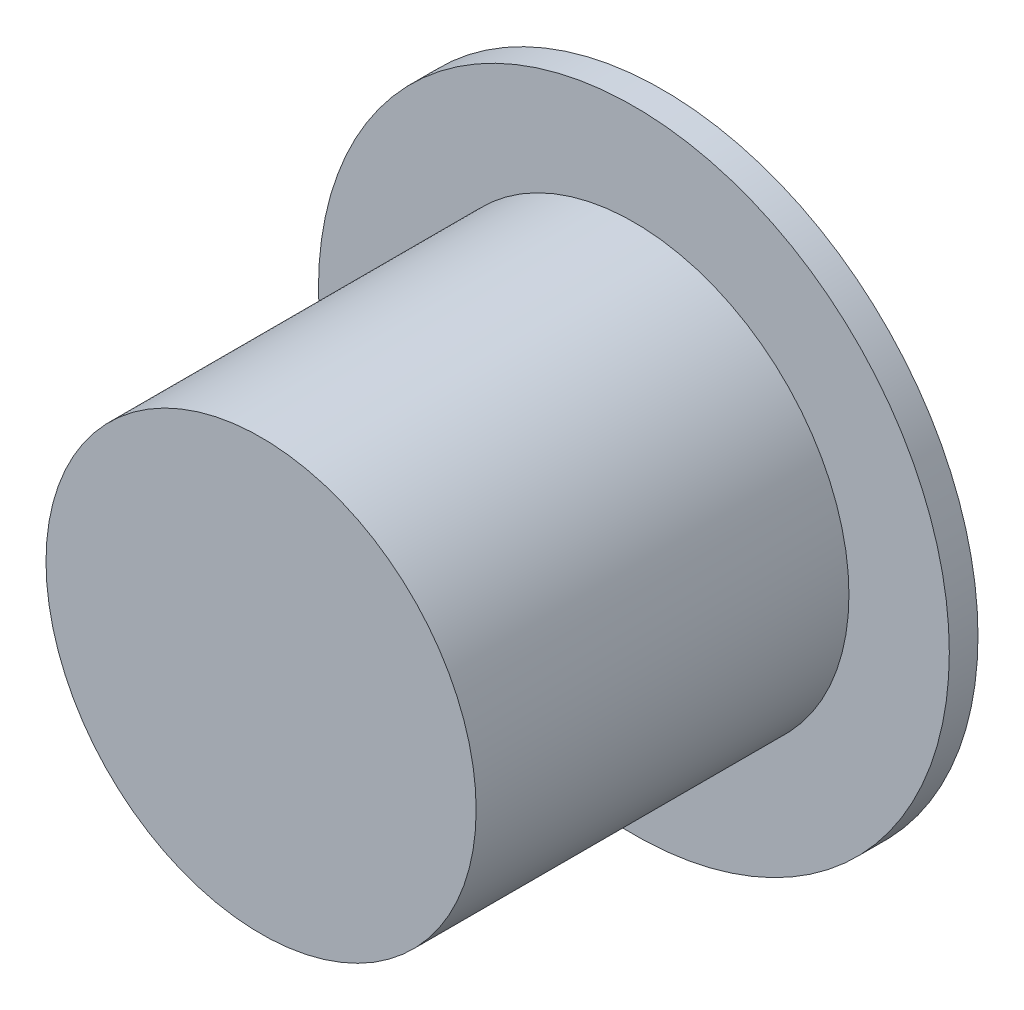
ISO-10303-21;
HEADER;
FILE_DESCRIPTION(('STEP AP214'),'2;1');
FILE_NAME('part.step','',(''),(''),'','','');
FILE_SCHEMA(('AUTOMOTIVE_DESIGN { 1 0 10303 214 1 1 1 1 }'));
ENDSEC;
DATA;
#1=APPLICATION_CONTEXT('core data for automotive mechanical design processes');
#2=APPLICATION_PROTOCOL_DEFINITION('international standard','automotive_design',2000,#1);
#3=PRODUCT_CONTEXT('',#1,'mechanical');
#4=PRODUCT('Part','Part','',(#3));
#5=PRODUCT_RELATED_PRODUCT_CATEGORY('part','',(#4));
#6=PRODUCT_DEFINITION_FORMATION('','',#4);
#7=PRODUCT_DEFINITION_CONTEXT('part definition',#1,'design');
#8=PRODUCT_DEFINITION('design','',#6,#7);
#9=PRODUCT_DEFINITION_SHAPE('','',#8);
#10=(LENGTH_UNIT() NAMED_UNIT(*) SI_UNIT(.MILLI.,.METRE.));
#11=(NAMED_UNIT(*) PLANE_ANGLE_UNIT() SI_UNIT($,.RADIAN.));
#12=(NAMED_UNIT(*) SI_UNIT($,.STERADIAN.) SOLID_ANGLE_UNIT());
#13=UNCERTAINTY_MEASURE_WITH_UNIT(LENGTH_MEASURE(1.E-05),#10,'distance_accuracy_value','');
#14=(GEOMETRIC_REPRESENTATION_CONTEXT(3) GLOBAL_UNCERTAINTY_ASSIGNED_CONTEXT((#13)) GLOBAL_UNIT_ASSIGNED_CONTEXT((#10,
#11,#12)) REPRESENTATION_CONTEXT('',''));
#15=CARTESIAN_POINT('',(0.,0.,0.));
#16=DIRECTION('',(0.,0.,1.));
#17=DIRECTION('',(1.,0.,0.));
#18=AXIS2_PLACEMENT_3D('',#15,#16,#17);
#19=CARTESIAN_POINT('',(0.,0.,6.));
#20=DIRECTION('',(0.,0.,-1.));
#21=DIRECTION('',(-1.,0.,0.));
#22=AXIS2_PLACEMENT_3D('',#19,#20,#21);
#23=CYLINDRICAL_SURFACE('',#22,7.5);
#24=CARTESIAN_POINT('',(0.,0.,-5.));
#25=DIRECTION('',(0.,0.,-1.));
#26=DIRECTION('',(-1.,0.,0.));
#27=AXIS2_PLACEMENT_3D('',#24,#25,#26);
#28=CIRCLE('',#27,7.5);
#29=CARTESIAN_POINT('',(-7.5,0.,-5.));
#30=VERTEX_POINT('',#29);
#31=EDGE_CURVE('E11',#30,#30,#28,.T.);
#32=ORIENTED_EDGE('',*,*,#31,.F.);
#33=EDGE_LOOP('',(#32));
#34=FACE_BOUND('',#33,.T.);
#35=CARTESIAN_POINT('',(0.,0.,8.));
#36=DIRECTION('',(0.,0.,1.));
#37=DIRECTION('',(1.,0.,0.));
#38=AXIS2_PLACEMENT_3D('',#35,#36,#37);
#39=CIRCLE('',#38,7.5);
#40=CARTESIAN_POINT('',(7.5,0.,8.));
#41=VERTEX_POINT('',#40);
#42=EDGE_CURVE('E117',#41,#41,#39,.T.);
#43=ORIENTED_EDGE('',*,*,#42,.F.);
#44=EDGE_LOOP('',(#43));
#45=FACE_BOUND('',#44,.T.);
#46=ADVANCED_FACE('F39',(#34,#45),#23,.T.);
#47=CARTESIAN_POINT('',(0.,0.,-6.));
#48=DIRECTION('',(0.,0.,1.));
#49=DIRECTION('',(1.,0.,0.));
#50=AXIS2_PLACEMENT_3D('',#47,#48,#49);
#51=PLANE('',#50);
#52=DIRECTION('',(0.,1.,0.));
#53=VECTOR('',#52,1.);
#54=CARTESIAN_POINT('',(3.425,-3.425,-6.));
#55=LINE('',#54,#53);
#56=CARTESIAN_POINT('',(3.425,-3.425,-6.));
#57=VERTEX_POINT('',#56);
#58=CARTESIAN_POINT('',(3.425,3.425,-6.));
#59=VERTEX_POINT('',#58);
#60=EDGE_CURVE('E61',#57,#59,#55,.T.);
#61=ORIENTED_EDGE('',*,*,#60,.T.);
#62=DIRECTION('',(-1.,0.,0.));
#63=VECTOR('',#62,1.);
#64=CARTESIAN_POINT('',(-3.425,3.425,-6.));
#65=LINE('',#64,#63);
#66=CARTESIAN_POINT('',(-3.425,3.425,-6.));
#67=VERTEX_POINT('',#66);
#68=EDGE_CURVE('E108',#59,#67,#65,.T.);
#69=ORIENTED_EDGE('',*,*,#68,.T.);
#70=DIRECTION('',(0.,-1.,0.));
#71=VECTOR('',#70,1.);
#72=CARTESIAN_POINT('',(-3.425,-3.425,-6.));
#73=LINE('',#72,#71);
#74=CARTESIAN_POINT('',(-3.425,-3.425,-6.));
#75=VERTEX_POINT('',#74);
#76=EDGE_CURVE('E96',#67,#75,#73,.T.);
#77=ORIENTED_EDGE('',*,*,#76,.T.);
#78=DIRECTION('',(1.,0.,0.));
#79=VECTOR('',#78,1.);
#80=CARTESIAN_POINT('',(-3.425,-3.425,-6.));
#81=LINE('',#80,#79);
#82=EDGE_CURVE('E104',#75,#57,#81,.T.);
#83=ORIENTED_EDGE('',*,*,#82,.T.);
#84=EDGE_LOOP('',(#61,#69,#77,#83));
#85=FACE_BOUND('',#84,.T.);
#86=CARTESIAN_POINT('',(0.,0.,-6.));
#87=DIRECTION('',(0.,0.,-1.));
#88=DIRECTION('',(-1.,0.,0.));
#89=AXIS2_PLACEMENT_3D('',#86,#87,#88);
#90=CIRCLE('',#89,11.);
#91=CARTESIAN_POINT('',(-11.,0.,-6.));
#92=VERTEX_POINT('',#91);
#93=EDGE_CURVE('E114',#92,#92,#90,.T.);
#94=ORIENTED_EDGE('',*,*,#93,.T.);
#95=EDGE_LOOP('',(#94));
#96=FACE_BOUND('',#95,.T.);
#97=ADVANCED_FACE('F126',(#85,#96),#51,.F.);
#98=CARTESIAN_POINT('',(3.425,-3.425,6.));
#99=DIRECTION('',(-1.,0.,0.));
#100=DIRECTION('',(0.,0.,1.));
#101=AXIS2_PLACEMENT_3D('',#98,#99,#100);
#102=PLANE('',#101);
#103=ORIENTED_EDGE('',*,*,#60,.F.);
#104=DIRECTION('',(0.,0.,-1.));
#105=VECTOR('',#104,1.);
#106=CARTESIAN_POINT('',(3.425,-3.425,6.));
#107=LINE('',#106,#105);
#108=CARTESIAN_POINT('',(3.425,-3.425,6.));
#109=VERTEX_POINT('',#108);
#110=EDGE_CURVE('E100',#109,#57,#107,.T.);
#111=ORIENTED_EDGE('',*,*,#110,.F.);
#112=DIRECTION('',(0.,1.,0.));
#113=VECTOR('',#112,1.);
#114=CARTESIAN_POINT('',(3.425,-3.425,6.));
#115=LINE('',#114,#113);
#116=CARTESIAN_POINT('',(3.425,3.425,6.));
#117=VERTEX_POINT('',#116);
#118=EDGE_CURVE('E92',#109,#117,#115,.T.);
#119=ORIENTED_EDGE('',*,*,#118,.T.);
#120=DIRECTION('',(0.,0.,-1.));
#121=VECTOR('',#120,1.);
#122=CARTESIAN_POINT('',(3.425,3.425,6.));
#123=LINE('',#122,#121);
#124=EDGE_CURVE('E46',#117,#59,#123,.T.);
#125=ORIENTED_EDGE('',*,*,#124,.T.);
#126=EDGE_LOOP('',(#103,#111,#119,#125));
#127=FACE_BOUND('',#126,.T.);
#128=ADVANCED_FACE('F133',(#127),#102,.T.);
#129=CARTESIAN_POINT('',(-3.425,3.425,6.));
#130=DIRECTION('',(0.,-1.,0.));
#131=DIRECTION('',(0.,0.,-1.));
#132=AXIS2_PLACEMENT_3D('',#129,#130,#131);
#133=PLANE('',#132);
#134=ORIENTED_EDGE('',*,*,#68,.F.);
#135=ORIENTED_EDGE('',*,*,#124,.F.);
#136=DIRECTION('',(-1.,0.,0.));
#137=VECTOR('',#136,1.);
#138=CARTESIAN_POINT('',(-3.425,3.425,6.));
#139=LINE('',#138,#137);
#140=CARTESIAN_POINT('',(-3.425,3.425,6.));
#141=VERTEX_POINT('',#140);
#142=EDGE_CURVE('E82',#117,#141,#139,.T.);
#143=ORIENTED_EDGE('',*,*,#142,.T.);
#144=DIRECTION('',(0.,0.,-1.));
#145=VECTOR('',#144,1.);
#146=CARTESIAN_POINT('',(-3.425,3.425,6.));
#147=LINE('',#146,#145);
#148=EDGE_CURVE('E90',#141,#67,#147,.T.);
#149=ORIENTED_EDGE('',*,*,#148,.T.);
#150=EDGE_LOOP('',(#134,#135,#143,#149));
#151=FACE_BOUND('',#150,.T.);
#152=ADVANCED_FACE('F89',(#151),#133,.T.);
#153=CARTESIAN_POINT('',(-3.425,-3.425,6.));
#154=DIRECTION('',(1.,0.,0.));
#155=DIRECTION('',(0.,0.,-1.));
#156=AXIS2_PLACEMENT_3D('',#153,#154,#155);
#157=PLANE('',#156);
#158=ORIENTED_EDGE('',*,*,#76,.F.);
#159=ORIENTED_EDGE('',*,*,#148,.F.);
#160=DIRECTION('',(0.,-1.,0.));
#161=VECTOR('',#160,1.);
#162=CARTESIAN_POINT('',(-3.425,-3.425,6.));
#163=LINE('',#162,#161);
#164=CARTESIAN_POINT('',(-3.425,-3.425,6.));
#165=VERTEX_POINT('',#164);
#166=EDGE_CURVE('E79',#141,#165,#163,.T.);
#167=ORIENTED_EDGE('',*,*,#166,.T.);
#168=DIRECTION('',(0.,0.,-1.));
#169=VECTOR('',#168,1.);
#170=CARTESIAN_POINT('',(-3.425,-3.425,6.));
#171=LINE('',#170,#169);
#172=EDGE_CURVE('E98',#165,#75,#171,.T.);
#173=ORIENTED_EDGE('',*,*,#172,.T.);
#174=EDGE_LOOP('',(#158,#159,#167,#173));
#175=FACE_BOUND('',#174,.T.);
#176=ADVANCED_FACE('F94',(#175),#157,.T.);
#177=CARTESIAN_POINT('',(-3.425,-3.425,6.));
#178=DIRECTION('',(0.,1.,0.));
#179=DIRECTION('',(0.,0.,1.));
#180=AXIS2_PLACEMENT_3D('',#177,#178,#179);
#181=PLANE('',#180);
#182=ORIENTED_EDGE('',*,*,#82,.F.);
#183=ORIENTED_EDGE('',*,*,#172,.F.);
#184=DIRECTION('',(1.,0.,0.));
#185=VECTOR('',#184,1.);
#186=CARTESIAN_POINT('',(-3.425,-3.425,6.));
#187=LINE('',#186,#185);
#188=EDGE_CURVE('E53',#165,#109,#187,.T.);
#189=ORIENTED_EDGE('',*,*,#188,.T.);
#190=ORIENTED_EDGE('',*,*,#110,.T.);
#191=EDGE_LOOP('',(#182,#183,#189,#190));
#192=FACE_BOUND('',#191,.T.);
#193=ADVANCED_FACE('F145',(#192),#181,.T.);
#194=CARTESIAN_POINT('',(0.,0.,-5.));
#195=DIRECTION('',(0.,0.,-1.));
#196=DIRECTION('',(-1.,0.,0.));
#197=AXIS2_PLACEMENT_3D('',#194,#195,#196);
#198=CYLINDRICAL_SURFACE('',#197,11.);
#199=CARTESIAN_POINT('',(0.,0.,-5.));
#200=DIRECTION('',(0.,0.,-1.));
#201=DIRECTION('',(-1.,0.,0.));
#202=AXIS2_PLACEMENT_3D('',#199,#200,#201);
#203=CIRCLE('',#202,11.);
#204=CARTESIAN_POINT('',(-11.,0.,-5.));
#205=VERTEX_POINT('',#204);
#206=EDGE_CURVE('E111',#205,#205,#203,.T.);
#207=ORIENTED_EDGE('',*,*,#206,.T.);
#208=EDGE_LOOP('',(#207));
#209=FACE_BOUND('',#208,.T.);
#210=ORIENTED_EDGE('',*,*,#93,.F.);
#211=EDGE_LOOP('',(#210));
#212=FACE_BOUND('',#211,.T.);
#213=ADVANCED_FACE('F139',(#209,#212),#198,.T.);
#214=CARTESIAN_POINT('',(0.,0.,-5.));
#215=DIRECTION('',(0.,0.,-1.));
#216=DIRECTION('',(-1.,0.,0.));
#217=AXIS2_PLACEMENT_3D('',#214,#215,#216);
#218=PLANE('',#217);
#219=ORIENTED_EDGE('',*,*,#31,.T.);
#220=EDGE_LOOP('',(#219));
#221=FACE_BOUND('',#220,.T.);
#222=ORIENTED_EDGE('',*,*,#206,.F.);
#223=EDGE_LOOP('',(#222));
#224=FACE_BOUND('',#223,.T.);
#225=ADVANCED_FACE('F137',(#221,#224),#218,.F.);
#226=CARTESIAN_POINT('',(0.,0.,6.));
#227=DIRECTION('',(0.,0.,1.));
#228=DIRECTION('',(1.,0.,0.));
#229=AXIS2_PLACEMENT_3D('',#226,#227,#228);
#230=PLANE('',#229);
#231=ORIENTED_EDGE('',*,*,#142,.F.);
#232=ORIENTED_EDGE('',*,*,#118,.F.);
#233=ORIENTED_EDGE('',*,*,#188,.F.);
#234=ORIENTED_EDGE('',*,*,#166,.F.);
#235=EDGE_LOOP('',(#231,#232,#233,#234));
#236=FACE_BOUND('',#235,.T.);
#237=ADVANCED_FACE('F81',(#236),#230,.F.);
#238=CARTESIAN_POINT('',(0.,0.,8.));
#239=DIRECTION('',(0.,0.,1.));
#240=DIRECTION('',(1.,0.,0.));
#241=AXIS2_PLACEMENT_3D('',#238,#239,#240);
#242=PLANE('',#241);
#243=ORIENTED_EDGE('',*,*,#42,.T.);
#244=EDGE_LOOP('',(#243));
#245=FACE_BOUND('',#244,.T.);
#246=ADVANCED_FACE('F123',(#245),#242,.T.);
#247=CLOSED_SHELL('',(#46,#97,#128,#152,#176,#193,#213,#225,#237,#246));
#248=MANIFOLD_SOLID_BREP('B2',#247);
#249=ADVANCED_BREP_SHAPE_REPRESENTATION('',(#18,#248),#14);
#250=SHAPE_DEFINITION_REPRESENTATION(#9,#249);
ENDSEC;
END-ISO-10303-21;
